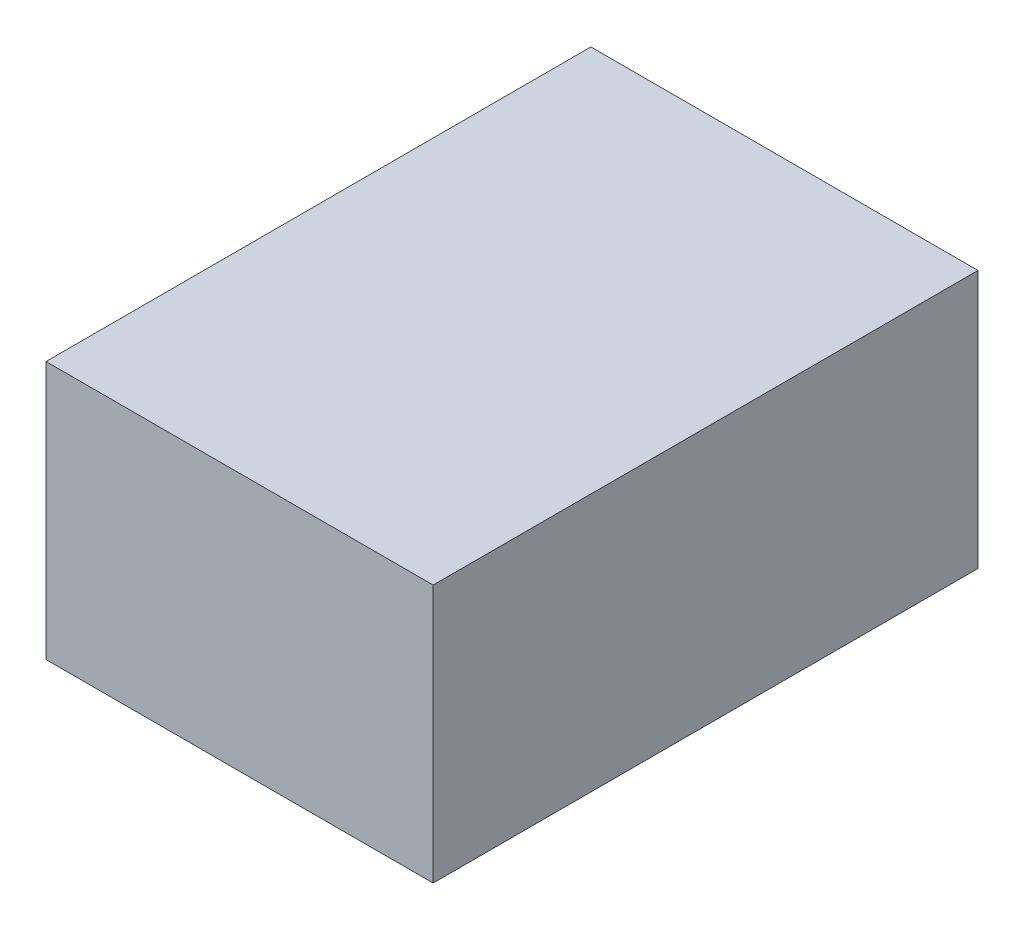
ISO-10303-21;
HEADER;
FILE_DESCRIPTION(('STEP AP214'),'2;1');
FILE_NAME('part.step','',(''),(''),'','','');
FILE_SCHEMA(('AUTOMOTIVE_DESIGN { 1 0 10303 214 1 1 1 1 }'));
ENDSEC;
DATA;
#1=APPLICATION_CONTEXT('core data for automotive mechanical design processes');
#2=APPLICATION_PROTOCOL_DEFINITION('international standard','automotive_design',2000,#1);
#3=PRODUCT_CONTEXT('',#1,'mechanical');
#4=PRODUCT('Part','Part','',(#3));
#5=PRODUCT_RELATED_PRODUCT_CATEGORY('part','',(#4));
#6=PRODUCT_DEFINITION_FORMATION('','',#4);
#7=PRODUCT_DEFINITION_CONTEXT('part definition',#1,'design');
#8=PRODUCT_DEFINITION('design','',#6,#7);
#9=PRODUCT_DEFINITION_SHAPE('','',#8);
#10=(LENGTH_UNIT() NAMED_UNIT(*) SI_UNIT(.MILLI.,.METRE.));
#11=(NAMED_UNIT(*) PLANE_ANGLE_UNIT() SI_UNIT($,.RADIAN.));
#12=(NAMED_UNIT(*) SI_UNIT($,.STERADIAN.) SOLID_ANGLE_UNIT());
#13=UNCERTAINTY_MEASURE_WITH_UNIT(LENGTH_MEASURE(1.E-05),#10,'distance_accuracy_value','');
#14=(GEOMETRIC_REPRESENTATION_CONTEXT(3) GLOBAL_UNCERTAINTY_ASSIGNED_CONTEXT((#13)) GLOBAL_UNIT_ASSIGNED_CONTEXT((#10,
#11,#12)) REPRESENTATION_CONTEXT('',''));
#15=CARTESIAN_POINT('',(0.,0.,0.));
#16=DIRECTION('',(0.,0.,1.));
#17=DIRECTION('',(1.,0.,0.));
#18=AXIS2_PLACEMENT_3D('',#15,#16,#17);
#19=CARTESIAN_POINT('',(0.,18.,0.));
#20=DIRECTION('',(1.,0.,0.));
#21=DIRECTION('',(0.,0.,-1.));
#22=AXIS2_PLACEMENT_3D('',#19,#20,#21);
#23=PLANE('',#22);
#24=DIRECTION('',(0.,0.,1.));
#25=VECTOR('',#24,1.);
#26=CARTESIAN_POINT('',(0.,0.,0.));
#27=LINE('',#26,#25);
#28=CARTESIAN_POINT('',(0.,0.,-38.));
#29=VERTEX_POINT('',#28);
#30=CARTESIAN_POINT('',(0.,0.,0.));
#31=VERTEX_POINT('',#30);
#32=EDGE_CURVE('E107',#29,#31,#27,.T.);
#33=ORIENTED_EDGE('',*,*,#32,.T.);
#34=DIRECTION('',(0.,-1.,0.));
#35=VECTOR('',#34,1.);
#36=CARTESIAN_POINT('',(0.,18.,0.));
#37=LINE('',#36,#35);
#38=CARTESIAN_POINT('',(0.,18.,0.));
#39=VERTEX_POINT('',#38);
#40=EDGE_CURVE('E11',#39,#31,#37,.T.);
#41=ORIENTED_EDGE('',*,*,#40,.F.);
#42=DIRECTION('',(0.,0.,1.));
#43=VECTOR('',#42,1.);
#44=CARTESIAN_POINT('',(0.,18.,0.));
#45=LINE('',#44,#43);
#46=CARTESIAN_POINT('',(0.,18.,-38.));
#47=VERTEX_POINT('',#46);
#48=EDGE_CURVE('E91',#47,#39,#45,.T.);
#49=ORIENTED_EDGE('',*,*,#48,.F.);
#50=DIRECTION('',(0.,-1.,0.));
#51=VECTOR('',#50,1.);
#52=CARTESIAN_POINT('',(0.,18.,-38.));
#53=LINE('',#52,#51);
#54=EDGE_CURVE('E103',#47,#29,#53,.T.);
#55=ORIENTED_EDGE('',*,*,#54,.T.);
#56=EDGE_LOOP('',(#33,#41,#49,#55));
#57=FACE_BOUND('',#56,.T.);
#58=ADVANCED_FACE('F39',(#57),#23,.F.);
#59=CARTESIAN_POINT('',(0.,18.,0.));
#60=DIRECTION('',(0.,0.,-1.));
#61=DIRECTION('',(-1.,0.,0.));
#62=AXIS2_PLACEMENT_3D('',#59,#60,#61);
#63=PLANE('',#62);
#64=DIRECTION('',(1.,0.,0.));
#65=VECTOR('',#64,1.);
#66=CARTESIAN_POINT('',(0.,0.,0.));
#67=LINE('',#66,#65);
#68=CARTESIAN_POINT('',(27.,0.,0.));
#69=VERTEX_POINT('',#68);
#70=EDGE_CURVE('E96',#31,#69,#67,.T.);
#71=ORIENTED_EDGE('',*,*,#70,.T.);
#72=DIRECTION('',(0.,-1.,0.));
#73=VECTOR('',#72,1.);
#74=CARTESIAN_POINT('',(27.,18.,0.));
#75=LINE('',#74,#73);
#76=CARTESIAN_POINT('',(27.,18.,0.));
#77=VERTEX_POINT('',#76);
#78=EDGE_CURVE('E48',#77,#69,#75,.T.);
#79=ORIENTED_EDGE('',*,*,#78,.F.);
#80=DIRECTION('',(1.,0.,0.));
#81=VECTOR('',#80,1.);
#82=CARTESIAN_POINT('',(0.,18.,0.));
#83=LINE('',#82,#81);
#84=EDGE_CURVE('E86',#39,#77,#83,.T.);
#85=ORIENTED_EDGE('',*,*,#84,.F.);
#86=ORIENTED_EDGE('',*,*,#40,.T.);
#87=EDGE_LOOP('',(#71,#79,#85,#86));
#88=FACE_BOUND('',#87,.T.);
#89=ADVANCED_FACE('F95',(#88),#63,.F.);
#90=CARTESIAN_POINT('',(27.,18.,0.));
#91=DIRECTION('',(-1.,0.,0.));
#92=DIRECTION('',(0.,0.,1.));
#93=AXIS2_PLACEMENT_3D('',#90,#91,#92);
#94=PLANE('',#93);
#95=DIRECTION('',(0.,0.,-1.));
#96=VECTOR('',#95,1.);
#97=CARTESIAN_POINT('',(27.,0.,0.));
#98=LINE('',#97,#96);
#99=CARTESIAN_POINT('',(27.,0.,-38.));
#100=VERTEX_POINT('',#99);
#101=EDGE_CURVE('E73',#69,#100,#98,.T.);
#102=ORIENTED_EDGE('',*,*,#101,.T.);
#103=DIRECTION('',(0.,-1.,0.));
#104=VECTOR('',#103,1.);
#105=CARTESIAN_POINT('',(27.,18.,-38.));
#106=LINE('',#105,#104);
#107=CARTESIAN_POINT('',(27.,18.,-38.));
#108=VERTEX_POINT('',#107);
#109=EDGE_CURVE('E98',#108,#100,#106,.T.);
#110=ORIENTED_EDGE('',*,*,#109,.F.);
#111=DIRECTION('',(0.,0.,-1.));
#112=VECTOR('',#111,1.);
#113=CARTESIAN_POINT('',(27.,18.,0.));
#114=LINE('',#113,#112);
#115=EDGE_CURVE('E89',#77,#108,#114,.T.);
#116=ORIENTED_EDGE('',*,*,#115,.F.);
#117=ORIENTED_EDGE('',*,*,#78,.T.);
#118=EDGE_LOOP('',(#102,#110,#116,#117));
#119=FACE_BOUND('',#118,.T.);
#120=ADVANCED_FACE('F99',(#119),#94,.F.);
#121=CARTESIAN_POINT('',(0.,18.,-38.));
#122=DIRECTION('',(0.,0.,1.));
#123=DIRECTION('',(1.,0.,0.));
#124=AXIS2_PLACEMENT_3D('',#121,#122,#123);
#125=PLANE('',#124);
#126=DIRECTION('',(-1.,0.,0.));
#127=VECTOR('',#126,1.);
#128=CARTESIAN_POINT('',(0.,0.,-38.));
#129=LINE('',#128,#127);
#130=EDGE_CURVE('E79',#100,#29,#129,.T.);
#131=ORIENTED_EDGE('',*,*,#130,.T.);
#132=ORIENTED_EDGE('',*,*,#54,.F.);
#133=DIRECTION('',(-1.,0.,0.));
#134=VECTOR('',#133,1.);
#135=CARTESIAN_POINT('',(0.,18.,-38.));
#136=LINE('',#135,#134);
#137=EDGE_CURVE('E56',#108,#47,#136,.T.);
#138=ORIENTED_EDGE('',*,*,#137,.F.);
#139=ORIENTED_EDGE('',*,*,#109,.T.);
#140=EDGE_LOOP('',(#131,#132,#138,#139));
#141=FACE_BOUND('',#140,.T.);
#142=ADVANCED_FACE('F120',(#141),#125,.F.);
#143=CARTESIAN_POINT('',(0.,18.,0.));
#144=DIRECTION('',(0.,-1.,0.));
#145=DIRECTION('',(0.,0.,-1.));
#146=AXIS2_PLACEMENT_3D('',#143,#144,#145);
#147=PLANE('',#146);
#148=ORIENTED_EDGE('',*,*,#48,.T.);
#149=ORIENTED_EDGE('',*,*,#84,.T.);
#150=ORIENTED_EDGE('',*,*,#115,.T.);
#151=ORIENTED_EDGE('',*,*,#137,.T.);
#152=EDGE_LOOP('',(#148,#149,#150,#151));
#153=FACE_BOUND('',#152,.T.);
#154=ADVANCED_FACE('F87',(#153),#147,.F.);
#155=CARTESIAN_POINT('',(0.,0.,0.));
#156=DIRECTION('',(0.,-1.,0.));
#157=DIRECTION('',(0.,0.,-1.));
#158=AXIS2_PLACEMENT_3D('',#155,#156,#157);
#159=PLANE('',#158);
#160=ORIENTED_EDGE('',*,*,#32,.F.);
#161=ORIENTED_EDGE('',*,*,#130,.F.);
#162=ORIENTED_EDGE('',*,*,#101,.F.);
#163=ORIENTED_EDGE('',*,*,#70,.F.);
#164=EDGE_LOOP('',(#160,#161,#162,#163));
#165=FACE_BOUND('',#164,.T.);
#166=ADVANCED_FACE('F123',(#165),#159,.T.);
#167=CLOSED_SHELL('',(#58,#89,#120,#142,#154,#166));
#168=MANIFOLD_SOLID_BREP('B2',#167);
#169=ADVANCED_BREP_SHAPE_REPRESENTATION('',(#18,#168),#14);
#170=SHAPE_DEFINITION_REPRESENTATION(#9,#169);
ENDSEC;
END-ISO-10303-21;
